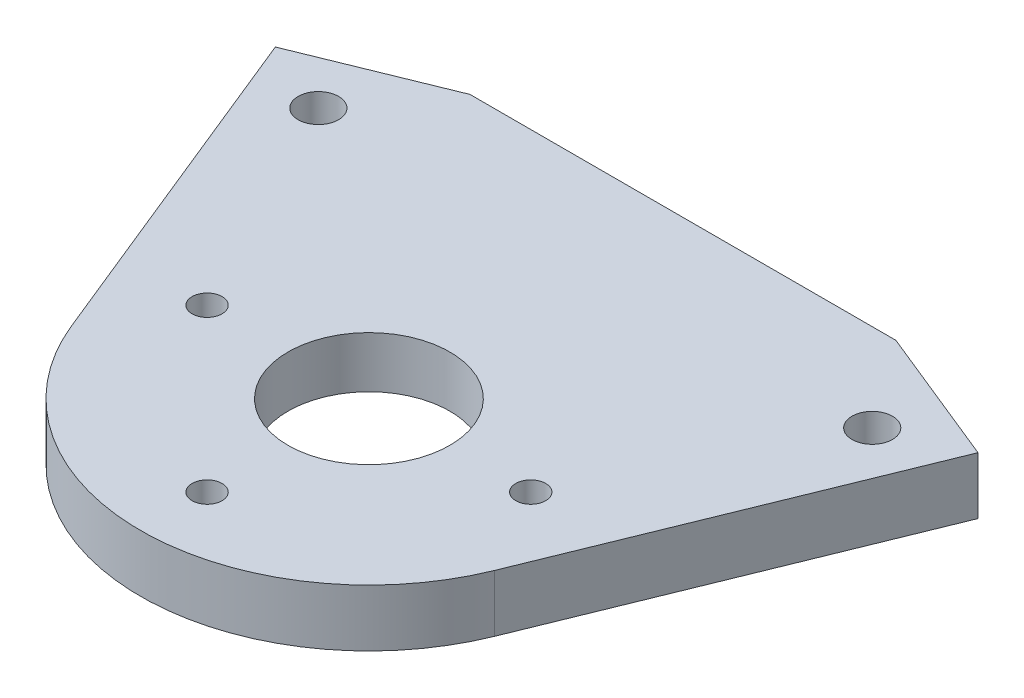
ISO-10303-21;
HEADER;
FILE_DESCRIPTION(('STEP AP214'),'2;1');
FILE_NAME('part.step','',(''),(''),'','','');
FILE_SCHEMA(('AUTOMOTIVE_DESIGN { 1 0 10303 214 1 1 1 1 }'));
ENDSEC;
DATA;
#1=APPLICATION_CONTEXT('core data for automotive mechanical design processes');
#2=APPLICATION_PROTOCOL_DEFINITION('international standard','automotive_design',2000,#1);
#3=PRODUCT_CONTEXT('',#1,'mechanical');
#4=PRODUCT('Part','Part','',(#3));
#5=PRODUCT_RELATED_PRODUCT_CATEGORY('part','',(#4));
#6=PRODUCT_DEFINITION_FORMATION('','',#4);
#7=PRODUCT_DEFINITION_CONTEXT('part definition',#1,'design');
#8=PRODUCT_DEFINITION('design','',#6,#7);
#9=PRODUCT_DEFINITION_SHAPE('','',#8);
#10=(LENGTH_UNIT() NAMED_UNIT(*) SI_UNIT(.MILLI.,.METRE.));
#11=(NAMED_UNIT(*) PLANE_ANGLE_UNIT() SI_UNIT($,.RADIAN.));
#12=(NAMED_UNIT(*) SI_UNIT($,.STERADIAN.) SOLID_ANGLE_UNIT());
#13=UNCERTAINTY_MEASURE_WITH_UNIT(LENGTH_MEASURE(1.E-05),#10,'distance_accuracy_value','');
#14=(GEOMETRIC_REPRESENTATION_CONTEXT(3) GLOBAL_UNCERTAINTY_ASSIGNED_CONTEXT((#13)) GLOBAL_UNIT_ASSIGNED_CONTEXT((#10,
#11,#12)) REPRESENTATION_CONTEXT('',''));
#15=CARTESIAN_POINT('',(0.,0.,0.));
#16=DIRECTION('',(0.,0.,1.));
#17=DIRECTION('',(1.,0.,0.));
#18=AXIS2_PLACEMENT_3D('',#15,#16,#17);
#19=CARTESIAN_POINT('',(0.,-26.9875,153.3144));
#20=DIRECTION('',(0.,1.,0.));
#21=DIRECTION('',(0.,0.,1.));
#22=AXIS2_PLACEMENT_3D('',#19,#20,#21);
#23=CYLINDRICAL_SURFACE('',#22,11.);
#24=CARTESIAN_POINT('',(0.,-26.3375000000001,153.3144));
#25=DIRECTION('',(0.,1.,0.));
#26=DIRECTION('',(0.,0.,1.));
#27=AXIS2_PLACEMENT_3D('',#24,#25,#26);
#28=CIRCLE('',#27,11.);
#29=CARTESIAN_POINT('',(0.,-26.3375000000001,164.3144));
#30=VERTEX_POINT('',#29);
#31=EDGE_CURVE('E153',#30,#30,#28,.F.);
#32=ORIENTED_EDGE('',*,*,#31,.F.);
#33=EDGE_LOOP('',(#32));
#34=FACE_BOUND('',#33,.T.);
#35=CARTESIAN_POINT('',(0.,-26.9875,153.3144));
#36=DIRECTION('',(0.,1.,0.));
#37=DIRECTION('',(0.,0.,1.));
#38=AXIS2_PLACEMENT_3D('',#35,#36,#37);
#39=CIRCLE('',#38,11.);
#40=CARTESIAN_POINT('',(0.,-26.9875,164.3144));
#41=VERTEX_POINT('',#40);
#42=EDGE_CURVE('E20',#41,#41,#39,.F.);
#43=ORIENTED_EDGE('',*,*,#42,.T.);
#44=EDGE_LOOP('',(#43));
#45=FACE_BOUND('',#44,.T.);
#46=ADVANCED_FACE('F17',(#34,#45),#23,.F.);
#47=CARTESIAN_POINT('',(0.,-26.9875,148.5519));
#48=DIRECTION('',(0.,1.,0.));
#49=DIRECTION('',(0.,0.,1.));
#50=AXIS2_PLACEMENT_3D('',#47,#48,#49);
#51=PLANE('',#50);
#52=ORIENTED_EDGE('',*,*,#42,.F.);
#53=EDGE_LOOP('',(#52));
#54=FACE_BOUND('',#53,.T.);
#55=CARTESIAN_POINT('',(30.8013963170544,-26.9875,128.136391541829));
#56=DIRECTION('',(0.,1.,0.));
#57=DIRECTION('',(0.,0.,1.));
#58=AXIS2_PLACEMENT_3D('',#55,#56,#57);
#59=CIRCLE('',#58,2.25);
#60=CARTESIAN_POINT('',(30.8013963170544,-26.9875,130.386391541829));
#61=VERTEX_POINT('',#60);
#62=EDGE_CURVE('E182',#61,#61,#59,.T.);
#63=ORIENTED_EDGE('',*,*,#62,.T.);
#64=EDGE_LOOP('',(#63));
#65=FACE_BOUND('',#64,.T.);
#66=CARTESIAN_POINT('',(-30.8013963170544,-26.9875,128.136391541829));
#67=DIRECTION('',(0.,1.,0.));
#68=DIRECTION('',(0.,0.,1.));
#69=AXIS2_PLACEMENT_3D('',#66,#67,#68);
#70=CIRCLE('',#69,2.25);
#71=CARTESIAN_POINT('',(-30.8013963170544,-26.9875,130.386391541829));
#72=VERTEX_POINT('',#71);
#73=EDGE_CURVE('E185',#72,#72,#70,.T.);
#74=ORIENTED_EDGE('',*,*,#73,.T.);
#75=EDGE_LOOP('',(#74));
#76=FACE_BOUND('',#75,.T.);
#77=CARTESIAN_POINT('',(18.,-26.9875,153.3144));
#78=DIRECTION('',(0.,1.,0.));
#79=DIRECTION('',(0.,0.,1.));
#80=AXIS2_PLACEMENT_3D('',#77,#78,#79);
#81=CIRCLE('',#80,1.666);
#82=CARTESIAN_POINT('',(18.,-26.9875,154.9804));
#83=VERTEX_POINT('',#82);
#84=EDGE_CURVE('E188',#83,#83,#81,.T.);
#85=ORIENTED_EDGE('',*,*,#84,.T.);
#86=EDGE_LOOP('',(#85));
#87=FACE_BOUND('',#86,.T.);
#88=CARTESIAN_POINT('',(-18.,-26.9875,153.3144));
#89=DIRECTION('',(0.,1.,0.));
#90=DIRECTION('',(0.,0.,1.));
#91=AXIS2_PLACEMENT_3D('',#88,#89,#90);
#92=CIRCLE('',#91,1.666);
#93=CARTESIAN_POINT('',(-18.,-26.9875,154.9804));
#94=VERTEX_POINT('',#93);
#95=EDGE_CURVE('E191',#94,#94,#92,.T.);
#96=ORIENTED_EDGE('',*,*,#95,.T.);
#97=EDGE_LOOP('',(#96));
#98=FACE_BOUND('',#97,.T.);
#99=CARTESIAN_POINT('',(0.,-26.9875,171.3144));
#100=DIRECTION('',(0.,1.,0.));
#101=DIRECTION('',(0.,0.,1.));
#102=AXIS2_PLACEMENT_3D('',#99,#100,#101);
#103=CIRCLE('',#102,1.666);
#104=CARTESIAN_POINT('',(0.,-26.9875,172.9804));
#105=VERTEX_POINT('',#104);
#106=EDGE_CURVE('E102',#105,#105,#103,.T.);
#107=ORIENTED_EDGE('',*,*,#106,.T.);
#108=EDGE_LOOP('',(#107));
#109=FACE_BOUND('',#108,.T.);
#110=DIRECTION('',(-0.926358334805579,0.,-0.376643379785487));
#111=VECTOR('',#110,1.);
#112=CARTESIAN_POINT('',(39.0754572047078,-26.9875,124.645701577451));
#113=LINE('',#112,#111);
#114=CARTESIAN_POINT('',(39.0754572047076,-26.9875,124.645701577451));
#115=VERTEX_POINT('',#114);
#116=CARTESIAN_POINT('',(23.6880179919705,-26.9875,118.3894));
#117=VERTEX_POINT('',#116);
#118=EDGE_CURVE('E78',#115,#117,#113,.T.);
#119=ORIENTED_EDGE('',*,*,#118,.F.);
#120=DIRECTION('',(0.376643379785485,0.,-0.92635833480558));
#121=VECTOR('',#120,1.);
#122=CARTESIAN_POINT('',(23.5295017040618,-26.9875,162.881141846551));
#123=LINE('',#122,#121);
#124=CARTESIAN_POINT('',(23.5295017040618,-26.9875,162.881141846551));
#125=VERTEX_POINT('',#124);
#126=EDGE_CURVE('E101',#125,#115,#123,.T.);
#127=ORIENTED_EDGE('',*,*,#126,.F.);
#128=CARTESIAN_POINT('',(0.,-26.9875,153.3144));
#129=DIRECTION('',(0.,1.,0.));
#130=DIRECTION('',(0.,0.,1.));
#131=AXIS2_PLACEMENT_3D('',#128,#129,#130);
#132=CIRCLE('',#131,25.4);
#133=CARTESIAN_POINT('',(-23.5295017040617,-26.9875,162.881141846551));
#134=VERTEX_POINT('',#133);
#135=EDGE_CURVE('E121',#134,#125,#132,.T.);
#136=ORIENTED_EDGE('',*,*,#135,.F.);
#137=DIRECTION('',(0.376643379785485,0.,0.92635833480558));
#138=VECTOR('',#137,1.);
#139=CARTESIAN_POINT('',(-39.0754572047075,-26.9875,124.645701577451));
#140=LINE('',#139,#138);
#141=CARTESIAN_POINT('',(-39.0754572047076,-26.9875,124.645701577451));
#142=VERTEX_POINT('',#141);
#143=EDGE_CURVE('E47',#142,#134,#140,.T.);
#144=ORIENTED_EDGE('',*,*,#143,.F.);
#145=DIRECTION('',(-0.926358334805579,0.,0.376643379785487));
#146=VECTOR('',#145,1.);
#147=CARTESIAN_POINT('',(-23.6880179919705,-26.9875,118.3894));
#148=LINE('',#147,#146);
#149=CARTESIAN_POINT('',(-23.6880179919705,-26.9875,118.3894));
#150=VERTEX_POINT('',#149);
#151=EDGE_CURVE('E57',#150,#142,#148,.T.);
#152=ORIENTED_EDGE('',*,*,#151,.F.);
#153=DIRECTION('',(-1.,0.,0.));
#154=VECTOR('',#153,1.);
#155=CARTESIAN_POINT('',(23.6880179919705,-26.9875,118.3894));
#156=LINE('',#155,#154);
#157=EDGE_CURVE('E142',#117,#150,#156,.T.);
#158=ORIENTED_EDGE('',*,*,#157,.F.);
#159=EDGE_LOOP('',(#119,#127,#136,#144,#152,#158));
#160=FACE_BOUND('',#159,.T.);
#161=ADVANCED_FACE('F203',(#54,#65,#76,#87,#98,#109,#160),#51,.F.);
#162=CARTESIAN_POINT('',(0.,-26.3375000000001,153.3144));
#163=DIRECTION('',(0.,-1.,0.));
#164=DIRECTION('',(0.,0.,-1.));
#165=AXIS2_PLACEMENT_3D('',#162,#163,#164);
#166=PLANE('',#165);
#167=CARTESIAN_POINT('',(0.,-26.3375000000001,153.3144));
#168=DIRECTION('',(0.,1.,0.));
#169=DIRECTION('',(0.,0.,1.));
#170=AXIS2_PLACEMENT_3D('',#167,#168,#169);
#171=CIRCLE('',#170,8.99999999999999);
#172=CARTESIAN_POINT('',(0.,-26.3375000000001,162.3144));
#173=VERTEX_POINT('',#172);
#174=EDGE_CURVE('E95',#173,#173,#171,.T.);
#175=ORIENTED_EDGE('',*,*,#174,.T.);
#176=EDGE_LOOP('',(#175));
#177=FACE_BOUND('',#176,.T.);
#178=ORIENTED_EDGE('',*,*,#31,.T.);
#179=EDGE_LOOP('',(#178));
#180=FACE_BOUND('',#179,.T.);
#181=ADVANCED_FACE('F206',(#177,#180),#166,.T.);
#182=CARTESIAN_POINT('',(39.0754572047078,-26.9875,124.645701577451));
#183=DIRECTION('',(0.376643379785487,0.,-0.926358334805579));
#184=DIRECTION('',(-0.926358334805579,0.,-0.376643379785487));
#185=AXIS2_PLACEMENT_3D('',#182,#183,#184);
#186=PLANE('',#185);
#187=ORIENTED_EDGE('',*,*,#118,.T.);
#188=DIRECTION('',(0.,1.,0.));
#189=VECTOR('',#188,1.);
#190=CARTESIAN_POINT('',(23.6880179919705,-26.9875,118.3894));
#191=LINE('',#190,#189);
#192=CARTESIAN_POINT('',(23.6880179919705,-20.6375,118.3894));
#193=VERTEX_POINT('',#192);
#194=EDGE_CURVE('E89',#193,#117,#191,.F.);
#195=ORIENTED_EDGE('',*,*,#194,.F.);
#196=DIRECTION('',(-0.926358334805579,0.,-0.376643379785486));
#197=VECTOR('',#196,1.);
#198=CARTESIAN_POINT('',(39.0754572047078,-20.6375,124.645701577451));
#199=LINE('',#198,#197);
#200=CARTESIAN_POINT('',(39.0754572047077,-20.6375,124.645701577451));
#201=VERTEX_POINT('',#200);
#202=EDGE_CURVE('E83',#201,#193,#199,.T.);
#203=ORIENTED_EDGE('',*,*,#202,.F.);
#204=DIRECTION('',(0.,1.,0.));
#205=VECTOR('',#204,1.);
#206=CARTESIAN_POINT('',(39.0754572047076,-26.9875,124.645701577451));
#207=LINE('',#206,#205);
#208=EDGE_CURVE('E86',#115,#201,#207,.T.);
#209=ORIENTED_EDGE('',*,*,#208,.F.);
#210=EDGE_LOOP('',(#187,#195,#203,#209));
#211=FACE_BOUND('',#210,.T.);
#212=ADVANCED_FACE('F85',(#211),#186,.T.);
#213=CARTESIAN_POINT('',(23.6880179919705,-26.9875,118.3894));
#214=DIRECTION('',(0.,0.,-1.));
#215=DIRECTION('',(-1.,0.,0.));
#216=AXIS2_PLACEMENT_3D('',#213,#214,#215);
#217=PLANE('',#216);
#218=ORIENTED_EDGE('',*,*,#157,.T.);
#219=DIRECTION('',(0.,1.,0.));
#220=VECTOR('',#219,1.);
#221=CARTESIAN_POINT('',(-23.6880179919705,-26.9875,118.3894));
#222=LINE('',#221,#220);
#223=CARTESIAN_POINT('',(-23.6880179919705,-20.6375,118.3894));
#224=VERTEX_POINT('',#223);
#225=EDGE_CURVE('E139',#224,#150,#222,.F.);
#226=ORIENTED_EDGE('',*,*,#225,.F.);
#227=DIRECTION('',(1.,0.,0.));
#228=VECTOR('',#227,1.);
#229=CARTESIAN_POINT('',(0.,-20.6375,118.3894));
#230=LINE('',#229,#228);
#231=EDGE_CURVE('E94',#193,#224,#230,.F.);
#232=ORIENTED_EDGE('',*,*,#231,.F.);
#233=ORIENTED_EDGE('',*,*,#194,.T.);
#234=EDGE_LOOP('',(#218,#226,#232,#233));
#235=FACE_BOUND('',#234,.T.);
#236=ADVANCED_FACE('F333',(#235),#217,.T.);
#237=CARTESIAN_POINT('',(-23.6880179919705,-26.9875,118.3894));
#238=DIRECTION('',(-0.376643379785487,0.,-0.926358334805579));
#239=DIRECTION('',(-0.926358334805579,0.,0.376643379785487));
#240=AXIS2_PLACEMENT_3D('',#237,#238,#239);
#241=PLANE('',#240);
#242=ORIENTED_EDGE('',*,*,#151,.T.);
#243=DIRECTION('',(0.,1.,0.));
#244=VECTOR('',#243,1.);
#245=CARTESIAN_POINT('',(-39.0754572047076,-26.9875,124.645701577451));
#246=LINE('',#245,#244);
#247=CARTESIAN_POINT('',(-39.0754572047077,-20.6375,124.645701577451));
#248=VERTEX_POINT('',#247);
#249=EDGE_CURVE('E130',#248,#142,#246,.F.);
#250=ORIENTED_EDGE('',*,*,#249,.F.);
#251=DIRECTION('',(-0.926358334805579,0.,0.376643379785486));
#252=VECTOR('',#251,1.);
#253=CARTESIAN_POINT('',(-23.6880179919705,-20.6375,118.3894));
#254=LINE('',#253,#252);
#255=EDGE_CURVE('E118',#224,#248,#254,.T.);
#256=ORIENTED_EDGE('',*,*,#255,.F.);
#257=ORIENTED_EDGE('',*,*,#225,.T.);
#258=EDGE_LOOP('',(#242,#250,#256,#257));
#259=FACE_BOUND('',#258,.T.);
#260=ADVANCED_FACE('F325',(#259),#241,.T.);
#261=CARTESIAN_POINT('',(-39.0754572047075,-26.9875,124.645701577451));
#262=DIRECTION('',(-0.92635833480558,0.,0.376643379785485));
#263=DIRECTION('',(0.376643379785485,0.,0.92635833480558));
#264=AXIS2_PLACEMENT_3D('',#261,#262,#263);
#265=PLANE('',#264);
#266=ORIENTED_EDGE('',*,*,#143,.T.);
#267=DIRECTION('',(0.,1.,0.));
#268=VECTOR('',#267,1.);
#269=CARTESIAN_POINT('',(-23.5295017040618,-26.9875,162.881141846551));
#270=LINE('',#269,#268);
#271=CARTESIAN_POINT('',(-23.5295017040617,-20.6375,162.881141846551));
#272=VERTEX_POINT('',#271);
#273=EDGE_CURVE('E127',#272,#134,#270,.F.);
#274=ORIENTED_EDGE('',*,*,#273,.F.);
#275=DIRECTION('',(0.37664337978549,0.,0.926358334805578));
#276=VECTOR('',#275,1.);
#277=CARTESIAN_POINT('',(-39.0754572047078,-20.6375,124.645701577451));
#278=LINE('',#277,#276);
#279=EDGE_CURVE('E112',#248,#272,#278,.T.);
#280=ORIENTED_EDGE('',*,*,#279,.F.);
#281=ORIENTED_EDGE('',*,*,#249,.T.);
#282=EDGE_LOOP('',(#266,#274,#280,#281));
#283=FACE_BOUND('',#282,.T.);
#284=ADVANCED_FACE('F317',(#283),#265,.T.);
#285=CARTESIAN_POINT('',(0.,-26.9875,153.3144));
#286=DIRECTION('',(0.,1.,0.));
#287=DIRECTION('',(0.,0.,1.));
#288=AXIS2_PLACEMENT_3D('',#285,#286,#287);
#289=CYLINDRICAL_SURFACE('',#288,25.4);
#290=ORIENTED_EDGE('',*,*,#135,.T.);
#291=DIRECTION('',(0.,1.,0.));
#292=VECTOR('',#291,1.);
#293=CARTESIAN_POINT('',(23.5295017040618,-26.9875,162.881141846551));
#294=LINE('',#293,#292);
#295=CARTESIAN_POINT('',(23.5295017040617,-20.6375,162.881141846551));
#296=VERTEX_POINT('',#295);
#297=EDGE_CURVE('E35',#296,#125,#294,.F.);
#298=ORIENTED_EDGE('',*,*,#297,.F.);
#299=CARTESIAN_POINT('',(0.,-20.6375,153.3144));
#300=DIRECTION('',(0.,1.,0.));
#301=DIRECTION('',(0.,0.,1.));
#302=AXIS2_PLACEMENT_3D('',#299,#300,#301);
#303=CIRCLE('',#302,25.4);
#304=EDGE_CURVE('E106',#272,#296,#303,.T.);
#305=ORIENTED_EDGE('',*,*,#304,.F.);
#306=ORIENTED_EDGE('',*,*,#273,.T.);
#307=EDGE_LOOP('',(#290,#298,#305,#306));
#308=FACE_BOUND('',#307,.T.);
#309=ADVANCED_FACE('F230',(#308),#289,.T.);
#310=CARTESIAN_POINT('',(23.5295017040618,-26.9875,162.881141846551));
#311=DIRECTION('',(0.92635833480558,0.,0.376643379785485));
#312=DIRECTION('',(0.376643379785485,0.,-0.92635833480558));
#313=AXIS2_PLACEMENT_3D('',#310,#311,#312);
#314=PLANE('',#313);
#315=ORIENTED_EDGE('',*,*,#126,.T.);
#316=ORIENTED_EDGE('',*,*,#208,.T.);
#317=DIRECTION('',(0.376643379785489,0.,-0.926358334805578));
#318=VECTOR('',#317,1.);
#319=CARTESIAN_POINT('',(23.5295017040618,-20.6375,162.881141846551));
#320=LINE('',#319,#318);
#321=EDGE_CURVE('E99',#296,#201,#320,.T.);
#322=ORIENTED_EDGE('',*,*,#321,.F.);
#323=ORIENTED_EDGE('',*,*,#297,.T.);
#324=EDGE_LOOP('',(#315,#316,#322,#323));
#325=FACE_BOUND('',#324,.T.);
#326=ADVANCED_FACE('F98',(#325),#314,.T.);
#327=CARTESIAN_POINT('',(0.,-26.3525,171.3144));
#328=DIRECTION('',(0.,1.,0.));
#329=DIRECTION('',(0.,0.,1.));
#330=AXIS2_PLACEMENT_3D('',#327,#328,#329);
#331=CYLINDRICAL_SURFACE('',#330,1.666);
#332=CARTESIAN_POINT('',(0.,-20.6375,171.3144));
#333=DIRECTION('',(0.,1.,0.));
#334=DIRECTION('',(0.,0.,1.));
#335=AXIS2_PLACEMENT_3D('',#332,#333,#334);
#336=CIRCLE('',#335,1.666);
#337=CARTESIAN_POINT('',(0.,-20.6375,172.9804));
#338=VERTEX_POINT('',#337);
#339=EDGE_CURVE('E107',#338,#338,#336,.F.);
#340=ORIENTED_EDGE('',*,*,#339,.F.);
#341=EDGE_LOOP('',(#340));
#342=FACE_BOUND('',#341,.T.);
#343=ORIENTED_EDGE('',*,*,#106,.F.);
#344=EDGE_LOOP('',(#343));
#345=FACE_BOUND('',#344,.T.);
#346=ADVANCED_FACE('F217',(#342,#345),#331,.F.);
#347=CARTESIAN_POINT('',(-18.,-26.3525,153.3144));
#348=DIRECTION('',(0.,1.,0.));
#349=DIRECTION('',(0.,0.,1.));
#350=AXIS2_PLACEMENT_3D('',#347,#348,#349);
#351=CYLINDRICAL_SURFACE('',#350,1.666);
#352=CARTESIAN_POINT('',(-18.,-20.6375,153.3144));
#353=DIRECTION('',(0.,1.,0.));
#354=DIRECTION('',(0.,0.,1.));
#355=AXIS2_PLACEMENT_3D('',#352,#353,#354);
#356=CIRCLE('',#355,1.666);
#357=CARTESIAN_POINT('',(-18.,-20.6375,154.9804));
#358=VERTEX_POINT('',#357);
#359=EDGE_CURVE('E110',#358,#358,#356,.F.);
#360=ORIENTED_EDGE('',*,*,#359,.F.);
#361=EDGE_LOOP('',(#360));
#362=FACE_BOUND('',#361,.T.);
#363=ORIENTED_EDGE('',*,*,#95,.F.);
#364=EDGE_LOOP('',(#363));
#365=FACE_BOUND('',#364,.T.);
#366=ADVANCED_FACE('F219',(#362,#365),#351,.F.);
#367=CARTESIAN_POINT('',(18.,-26.3525,153.3144));
#368=DIRECTION('',(0.,1.,0.));
#369=DIRECTION('',(0.,0.,1.));
#370=AXIS2_PLACEMENT_3D('',#367,#368,#369);
#371=CYLINDRICAL_SURFACE('',#370,1.666);
#372=CARTESIAN_POINT('',(18.,-20.6375,153.3144));
#373=DIRECTION('',(0.,1.,0.));
#374=DIRECTION('',(0.,0.,1.));
#375=AXIS2_PLACEMENT_3D('',#372,#373,#374);
#376=CIRCLE('',#375,1.666);
#377=CARTESIAN_POINT('',(18.,-20.6375,154.9804));
#378=VERTEX_POINT('',#377);
#379=EDGE_CURVE('E175',#378,#378,#376,.F.);
#380=ORIENTED_EDGE('',*,*,#379,.F.);
#381=EDGE_LOOP('',(#380));
#382=FACE_BOUND('',#381,.T.);
#383=ORIENTED_EDGE('',*,*,#84,.F.);
#384=EDGE_LOOP('',(#383));
#385=FACE_BOUND('',#384,.T.);
#386=ADVANCED_FACE('F227',(#382,#385),#371,.F.);
#387=CARTESIAN_POINT('',(-30.8013963170544,-0.158749999999994,128.136391541829));
#388=DIRECTION('',(0.,1.,0.));
#389=DIRECTION('',(0.,0.,1.));
#390=AXIS2_PLACEMENT_3D('',#387,#388,#389);
#391=CYLINDRICAL_SURFACE('',#390,2.25);
#392=CARTESIAN_POINT('',(-30.8013963170544,-20.6375,128.136391541829));
#393=DIRECTION('',(0.,1.,0.));
#394=DIRECTION('',(0.,0.,1.));
#395=AXIS2_PLACEMENT_3D('',#392,#393,#394);
#396=CIRCLE('',#395,2.25);
#397=CARTESIAN_POINT('',(-30.8013963170544,-20.6375,130.386391541829));
#398=VERTEX_POINT('',#397);
#399=EDGE_CURVE('E172',#398,#398,#396,.F.);
#400=ORIENTED_EDGE('',*,*,#399,.F.);
#401=EDGE_LOOP('',(#400));
#402=FACE_BOUND('',#401,.T.);
#403=ORIENTED_EDGE('',*,*,#73,.F.);
#404=EDGE_LOOP('',(#403));
#405=FACE_BOUND('',#404,.T.);
#406=ADVANCED_FACE('F247',(#402,#405),#391,.F.);
#407=CARTESIAN_POINT('',(30.8013963170544,-0.158749999999994,128.136391541829));
#408=DIRECTION('',(0.,1.,0.));
#409=DIRECTION('',(0.,0.,1.));
#410=AXIS2_PLACEMENT_3D('',#407,#408,#409);
#411=CYLINDRICAL_SURFACE('',#410,2.25);
#412=CARTESIAN_POINT('',(30.8013963170544,-20.6375,128.136391541829));
#413=DIRECTION('',(0.,1.,0.));
#414=DIRECTION('',(0.,0.,1.));
#415=AXIS2_PLACEMENT_3D('',#412,#413,#414);
#416=CIRCLE('',#415,2.25);
#417=CARTESIAN_POINT('',(30.8013963170544,-20.6375,130.386391541829));
#418=VERTEX_POINT('',#417);
#419=EDGE_CURVE('E26',#418,#418,#416,.F.);
#420=ORIENTED_EDGE('',*,*,#419,.F.);
#421=EDGE_LOOP('',(#420));
#422=FACE_BOUND('',#421,.T.);
#423=ORIENTED_EDGE('',*,*,#62,.F.);
#424=EDGE_LOOP('',(#423));
#425=FACE_BOUND('',#424,.T.);
#426=ADVANCED_FACE('F240',(#422,#425),#411,.F.);
#427=CARTESIAN_POINT('',(0.,-26.9875,153.3144));
#428=DIRECTION('',(0.,1.,0.));
#429=DIRECTION('',(0.,0.,1.));
#430=AXIS2_PLACEMENT_3D('',#427,#428,#429);
#431=CYLINDRICAL_SURFACE('',#430,8.99999999999999);
#432=CARTESIAN_POINT('',(0.,-20.6375,153.3144));
#433=DIRECTION('',(0.,1.,0.));
#434=DIRECTION('',(0.,0.,1.));
#435=AXIS2_PLACEMENT_3D('',#432,#433,#434);
#436=CIRCLE('',#435,8.99999999999999);
#437=CARTESIAN_POINT('',(0.,-20.6375,162.3144));
#438=VERTEX_POINT('',#437);
#439=EDGE_CURVE('E11',#438,#438,#436,.F.);
#440=ORIENTED_EDGE('',*,*,#439,.F.);
#441=EDGE_LOOP('',(#440));
#442=FACE_BOUND('',#441,.T.);
#443=ORIENTED_EDGE('',*,*,#174,.F.);
#444=EDGE_LOOP('',(#443));
#445=FACE_BOUND('',#444,.T.);
#446=ADVANCED_FACE('F234',(#442,#445),#431,.F.);
#447=CARTESIAN_POINT('',(0.,-20.6375,148.5519));
#448=DIRECTION('',(0.,1.,0.));
#449=DIRECTION('',(0.,0.,1.));
#450=AXIS2_PLACEMENT_3D('',#447,#448,#449);
#451=PLANE('',#450);
#452=ORIENTED_EDGE('',*,*,#439,.T.);
#453=EDGE_LOOP('',(#452));
#454=FACE_BOUND('',#453,.T.);
#455=ORIENTED_EDGE('',*,*,#419,.T.);
#456=EDGE_LOOP('',(#455));
#457=FACE_BOUND('',#456,.T.);
#458=ORIENTED_EDGE('',*,*,#399,.T.);
#459=EDGE_LOOP('',(#458));
#460=FACE_BOUND('',#459,.T.);
#461=ORIENTED_EDGE('',*,*,#379,.T.);
#462=EDGE_LOOP('',(#461));
#463=FACE_BOUND('',#462,.T.);
#464=ORIENTED_EDGE('',*,*,#359,.T.);
#465=EDGE_LOOP('',(#464));
#466=FACE_BOUND('',#465,.T.);
#467=ORIENTED_EDGE('',*,*,#339,.T.);
#468=EDGE_LOOP('',(#467));
#469=FACE_BOUND('',#468,.T.);
#470=ORIENTED_EDGE('',*,*,#304,.T.);
#471=ORIENTED_EDGE('',*,*,#321,.T.);
#472=ORIENTED_EDGE('',*,*,#202,.T.);
#473=ORIENTED_EDGE('',*,*,#231,.T.);
#474=ORIENTED_EDGE('',*,*,#255,.T.);
#475=ORIENTED_EDGE('',*,*,#279,.T.);
#476=EDGE_LOOP('',(#470,#471,#472,#473,#474,#475));
#477=FACE_BOUND('',#476,.T.);
#478=ADVANCED_FACE('F104',(#454,#457,#460,#463,#466,#469,#477),#451,.T.);
#479=CLOSED_SHELL('',(#46,#161,#181,#212,#236,#260,#284,#309,#326,#346,#366,#386,#406,#426,#446,#478));
#480=MANIFOLD_SOLID_BREP('B1',#479);
#481=ADVANCED_BREP_SHAPE_REPRESENTATION('',(#18,#480),#14);
#482=SHAPE_DEFINITION_REPRESENTATION(#9,#481);
ENDSEC;
END-ISO-10303-21;
